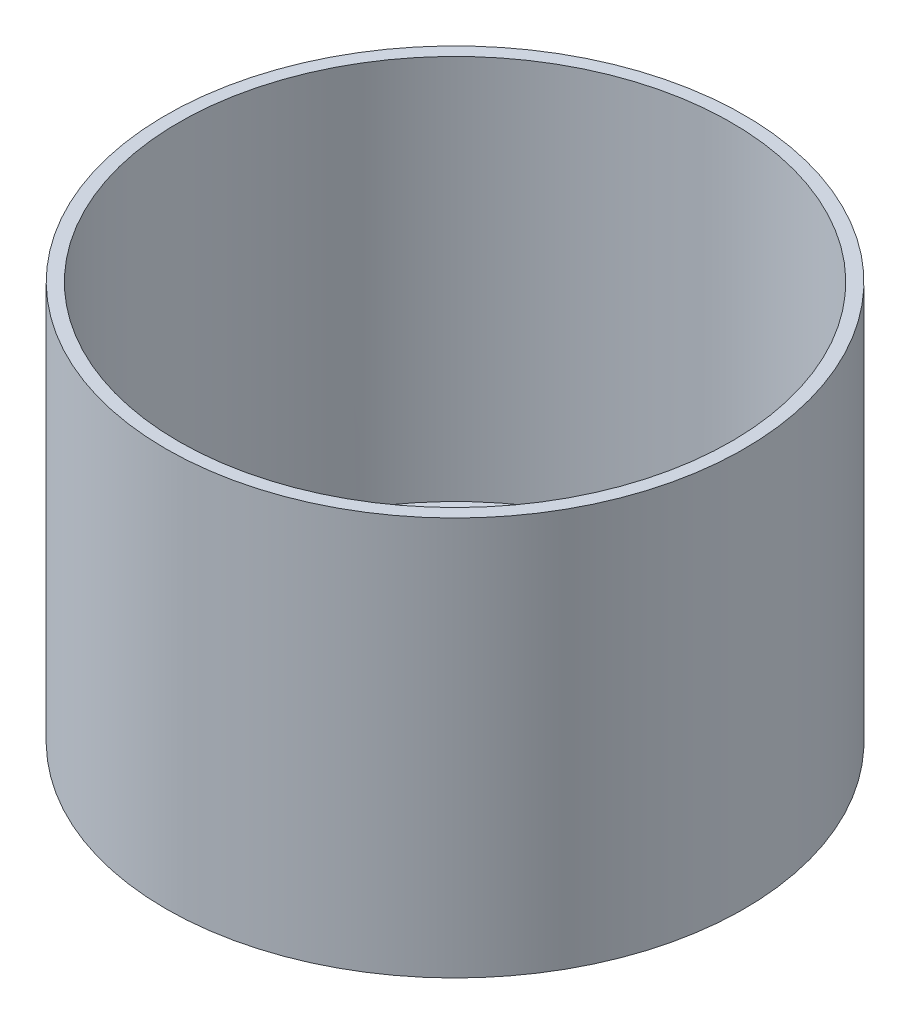
ISO-10303-21;
HEADER;
FILE_DESCRIPTION(('STEP AP214'),'2;1');
FILE_NAME('part.step','',(''),(''),'','','');
FILE_SCHEMA(('AUTOMOTIVE_DESIGN { 1 0 10303 214 1 1 1 1 }'));
ENDSEC;
DATA;
#1=APPLICATION_CONTEXT('core data for automotive mechanical design processes');
#2=APPLICATION_PROTOCOL_DEFINITION('international standard','automotive_design',2000,#1);
#3=PRODUCT_CONTEXT('',#1,'mechanical');
#4=PRODUCT('Part','Part','',(#3));
#5=PRODUCT_RELATED_PRODUCT_CATEGORY('part','',(#4));
#6=PRODUCT_DEFINITION_FORMATION('','',#4);
#7=PRODUCT_DEFINITION_CONTEXT('part definition',#1,'design');
#8=PRODUCT_DEFINITION('design','',#6,#7);
#9=PRODUCT_DEFINITION_SHAPE('','',#8);
#10=(LENGTH_UNIT() NAMED_UNIT(*) SI_UNIT(.MILLI.,.METRE.));
#11=(NAMED_UNIT(*) PLANE_ANGLE_UNIT() SI_UNIT($,.RADIAN.));
#12=(NAMED_UNIT(*) SI_UNIT($,.STERADIAN.) SOLID_ANGLE_UNIT());
#13=UNCERTAINTY_MEASURE_WITH_UNIT(LENGTH_MEASURE(1.E-05),#10,'distance_accuracy_value','');
#14=(GEOMETRIC_REPRESENTATION_CONTEXT(3) GLOBAL_UNCERTAINTY_ASSIGNED_CONTEXT((#13)) GLOBAL_UNIT_ASSIGNED_CONTEXT((#10,
#11,#12)) REPRESENTATION_CONTEXT('',''));
#15=CARTESIAN_POINT('',(0.,0.,0.));
#16=DIRECTION('',(0.,0.,1.));
#17=DIRECTION('',(1.,0.,0.));
#18=AXIS2_PLACEMENT_3D('',#15,#16,#17);
#19=CARTESIAN_POINT('',(16.5,62.,-24.5));
#20=DIRECTION('',(0.,-1.,0.));
#21=DIRECTION('',(0.,0.,-1.));
#22=AXIS2_PLACEMENT_3D('',#19,#20,#21);
#23=CYLINDRICAL_SURFACE('',#22,43.);
#24=CARTESIAN_POINT('',(16.5,62.,-24.5));
#25=DIRECTION('',(0.,1.,0.));
#26=DIRECTION('',(0.,0.,1.));
#27=AXIS2_PLACEMENT_3D('',#24,#25,#26);
#28=CIRCLE('',#27,43.);
#29=CARTESIAN_POINT('',(16.5,62.,18.5));
#30=VERTEX_POINT('',#29);
#31=EDGE_CURVE('E179',#30,#30,#28,.T.);
#32=ORIENTED_EDGE('',*,*,#31,.T.);
#33=EDGE_LOOP('',(#32));
#34=FACE_BOUND('',#33,.T.);
#35=CARTESIAN_POINT('',(16.5,2.,-24.5));
#36=DIRECTION('',(0.,1.,0.));
#37=DIRECTION('',(0.,0.,1.));
#38=AXIS2_PLACEMENT_3D('',#35,#36,#37);
#39=CIRCLE('',#38,43.);
#40=CARTESIAN_POINT('',(-12.7400336134731,2.,7.02808960725278));
#41=VERTEX_POINT('',#40);
#42=CARTESIAN_POINT('',(20.0246569480514,2.,18.3553006452942));
#43=VERTEX_POINT('',#42);
#44=EDGE_CURVE('E188',#41,#43,#39,.F.);
#45=ORIENTED_EDGE('',*,*,#44,.T.);
#46=DIRECTION('',(0.,-1.,0.));
#47=VECTOR('',#46,1.);
#48=CARTESIAN_POINT('',(20.0246569480514,12.,18.3553006452942));
#49=LINE('',#48,#47);
#50=CARTESIAN_POINT('',(20.0246569480514,22.,18.3553006452942));
#51=VERTEX_POINT('',#50);
#52=EDGE_CURVE('E176',#43,#51,#49,.F.);
#53=ORIENTED_EDGE('',*,*,#52,.T.);
#54=CARTESIAN_POINT('',(16.5,22.,-24.5));
#55=DIRECTION('',(0.,1.,0.));
#56=DIRECTION('',(0.,0.,1.));
#57=AXIS2_PLACEMENT_3D('',#54,#55,#56);
#58=CIRCLE('',#57,43.);
#59=CARTESIAN_POINT('',(5.42661257654479,22.,17.0497303357081));
#60=VERTEX_POINT('',#59);
#61=EDGE_CURVE('E11',#60,#51,#58,.T.);
#62=ORIENTED_EDGE('',*,*,#61,.F.);
#63=DIRECTION('',(0.,-1.,0.));
#64=VECTOR('',#63,1.);
#65=CARTESIAN_POINT('',(5.42661257654479,62.,17.0497303357081));
#66=LINE('',#65,#64);
#67=CARTESIAN_POINT('',(5.42661257654468,2.,17.0497303357081));
#68=VERTEX_POINT('',#67);
#69=EDGE_CURVE('E170',#60,#68,#66,.T.);
#70=ORIENTED_EDGE('',*,*,#69,.T.);
#71=CARTESIAN_POINT('',(0.140921145263424,2.,15.2665756512239));
#72=VERTEX_POINT('',#71);
#73=EDGE_CURVE('E189',#68,#72,#39,.F.);
#74=ORIENTED_EDGE('',*,*,#73,.T.);
#75=DIRECTION('',(0.,-1.,0.));
#76=VECTOR('',#75,1.);
#77=CARTESIAN_POINT('',(0.140921145263317,62.,15.2665756512238));
#78=LINE('',#77,#76);
#79=CARTESIAN_POINT('',(0.140921145263317,22.,15.2665756512238));
#80=VERTEX_POINT('',#79);
#81=EDGE_CURVE('E167',#72,#80,#78,.F.);
#82=ORIENTED_EDGE('',*,*,#81,.T.);
#83=CARTESIAN_POINT('',(-12.7400336134731,22.,7.02808960725279));
#84=VERTEX_POINT('',#83);
#85=EDGE_CURVE('E39',#84,#80,#58,.T.);
#86=ORIENTED_EDGE('',*,*,#85,.F.);
#87=DIRECTION('',(0.,-1.,0.));
#88=VECTOR('',#87,1.);
#89=CARTESIAN_POINT('',(-12.7400336134731,12.,7.02808960725278));
#90=LINE('',#89,#88);
#91=EDGE_CURVE('E173',#84,#41,#90,.T.);
#92=ORIENTED_EDGE('',*,*,#91,.T.);
#93=EDGE_LOOP('',(#45,#53,#62,#70,#74,#82,#86,#92));
#94=FACE_BOUND('',#93,.T.);
#95=ADVANCED_FACE('F35',(#34,#94),#23,.F.);
#96=CARTESIAN_POINT('',(16.5,2.,-24.5));
#97=DIRECTION('',(0.,1.,0.));
#98=DIRECTION('',(0.,0.,1.));
#99=AXIS2_PLACEMENT_3D('',#96,#97,#98);
#100=PLANE('',#99);
#101=DIRECTION('',(-0.947533885518577,0.,-0.319655339067048));
#102=VECTOR('',#101,1.);
#103=CARTESIAN_POINT('',(16.6228372296848,2.,5.73281430197921));
#104=LINE('',#103,#102);
#105=CARTESIAN_POINT('',(16.6228372296848,2.,5.73281430197921));
#106=VERTEX_POINT('',#105);
#107=CARTESIAN_POINT('',(13.7482956663537,2.,4.76307319600701));
#108=VERTEX_POINT('',#107);
#109=EDGE_CURVE('E125',#106,#108,#104,.T.);
#110=ORIENTED_EDGE('',*,*,#109,.F.);
#111=CARTESIAN_POINT('',(15.4191092150285,2.,12.8268711067982));
#112=DIRECTION('',(0.,1.,0.));
#113=DIRECTION('',(0.,0.,1.));
#114=AXIS2_PLACEMENT_3D('',#111,#112,#113);
#115=CIRCLE('',#114,7.19545711426782);
#116=EDGE_CURVE('E194',#106,#43,#115,.F.);
#117=ORIENTED_EDGE('',*,*,#116,.T.);
#118=ORIENTED_EDGE('',*,*,#44,.F.);
#119=CARTESIAN_POINT('',(0.,2.,0.));
#120=DIRECTION('',(0.,1.,0.));
#121=DIRECTION('',(0.,0.,1.));
#122=AXIS2_PLACEMENT_3D('',#119,#120,#121);
#123=CIRCLE('',#122,14.55);
#124=EDGE_CURVE('E151',#108,#41,#123,.T.);
#125=ORIENTED_EDGE('',*,*,#124,.F.);
#126=EDGE_LOOP('',(#110,#117,#118,#125));
#127=FACE_BOUND('',#126,.T.);
#128=ADVANCED_FACE('F211',(#127),#100,.T.);
#129=ORIENTED_EDGE('',*,*,#73,.F.);
#130=DIRECTION('',(-0.947533885518577,0.,-0.319655339067047));
#131=VECTOR('',#130,1.);
#132=CARTESIAN_POINT('',(2.78376686090405,2.,16.158152993466));
#133=LINE('',#132,#131);
#134=EDGE_CURVE('E192',#68,#72,#133,.T.);
#135=ORIENTED_EDGE('',*,*,#134,.T.);
#136=EDGE_LOOP('',(#129,#135));
#137=FACE_BOUND('',#136,.T.);
#138=ADVANCED_FACE('F209',(#137),#100,.T.);
#139=CARTESIAN_POINT('',(16.5,2.,-24.5));
#140=DIRECTION('',(0.,-1.,0.));
#141=DIRECTION('',(0.,0.,-1.));
#142=AXIS2_PLACEMENT_3D('',#139,#140,#141);
#143=CYLINDRICAL_SURFACE('',#142,45.);
#144=CARTESIAN_POINT('',(16.5,0.,-24.5));
#145=DIRECTION('',(0.,1.,0.));
#146=DIRECTION('',(0.,0.,1.));
#147=AXIS2_PLACEMENT_3D('',#144,#145,#146);
#148=CIRCLE('',#147,45.);
#149=CARTESIAN_POINT('',(16.5,0.,20.5));
#150=VERTEX_POINT('',#149);
#151=EDGE_CURVE('E185',#150,#150,#148,.T.);
#152=ORIENTED_EDGE('',*,*,#151,.T.);
#153=EDGE_LOOP('',(#152));
#154=FACE_BOUND('',#153,.T.);
#155=CARTESIAN_POINT('',(16.5,62.,-24.5));
#156=DIRECTION('',(0.,1.,0.));
#157=DIRECTION('',(0.,0.,1.));
#158=AXIS2_PLACEMENT_3D('',#155,#156,#157);
#159=CIRCLE('',#158,45.);
#160=CARTESIAN_POINT('',(16.5,62.,20.5));
#161=VERTEX_POINT('',#160);
#162=EDGE_CURVE('E182',#161,#161,#159,.T.);
#163=ORIENTED_EDGE('',*,*,#162,.F.);
#164=EDGE_LOOP('',(#163));
#165=FACE_BOUND('',#164,.T.);
#166=ADVANCED_FACE('F37',(#154,#165),#143,.T.);
#167=CARTESIAN_POINT('',(16.5,0.,-24.5));
#168=DIRECTION('',(0.,1.,0.));
#169=DIRECTION('',(0.,0.,1.));
#170=AXIS2_PLACEMENT_3D('',#167,#168,#169);
#171=PLANE('',#170);
#172=ORIENTED_EDGE('',*,*,#151,.F.);
#173=EDGE_LOOP('',(#172));
#174=FACE_BOUND('',#173,.T.);
#175=ADVANCED_FACE('F218',(#174),#171,.F.);
#176=CARTESIAN_POINT('',(16.5,62.,-24.5));
#177=DIRECTION('',(0.,1.,0.));
#178=DIRECTION('',(0.,0.,1.));
#179=AXIS2_PLACEMENT_3D('',#176,#177,#178);
#180=PLANE('',#179);
#181=ORIENTED_EDGE('',*,*,#162,.T.);
#182=EDGE_LOOP('',(#181));
#183=FACE_BOUND('',#182,.T.);
#184=ORIENTED_EDGE('',*,*,#31,.F.);
#185=EDGE_LOOP('',(#184));
#186=FACE_BOUND('',#185,.T.);
#187=ADVANCED_FACE('F231',(#183,#186),#180,.T.);
#188=CARTESIAN_POINT('',(15.4191092150285,22.,12.8268711067982));
#189=DIRECTION('',(0.,1.,0.));
#190=DIRECTION('',(0.,0.,1.));
#191=AXIS2_PLACEMENT_3D('',#188,#189,#190);
#192=PLANE('',#191);
#193=DIRECTION('',(-0.947533885518577,0.,-0.319655339067047));
#194=VECTOR('',#193,1.);
#195=CARTESIAN_POINT('',(16.4691425453701,22.,7.52994463900846));
#196=LINE('',#195,#194);
#197=CARTESIAN_POINT('',(16.4691425453701,22.,7.52994463900846));
#198=VERTEX_POINT('',#197);
#199=CARTESIAN_POINT('',(11.3524595635698,22.,5.8038058080464));
#200=VERTEX_POINT('',#199);
#201=EDGE_CURVE('E119',#198,#200,#196,.T.);
#202=ORIENTED_EDGE('',*,*,#201,.F.);
#203=CARTESIAN_POINT('',(15.4191092150285,22.,12.8268711067982));
#204=DIRECTION('',(0.,1.,0.));
#205=DIRECTION('',(0.,0.,1.));
#206=AXIS2_PLACEMENT_3D('',#203,#204,#205);
#207=CIRCLE('',#206,5.4);
#208=CARTESIAN_POINT('',(13.6929703840665,22.,17.9435540885985));
#209=VERTEX_POINT('',#208);
#210=EDGE_CURVE('E110',#209,#198,#207,.T.);
#211=ORIENTED_EDGE('',*,*,#210,.F.);
#212=DIRECTION('',(0.947533885518577,0.,0.319655339067047));
#213=VECTOR('',#212,1.);
#214=CARTESIAN_POINT('',(13.6929703840665,22.,17.9435540885985));
#215=LINE('',#214,#213);
#216=CARTESIAN_POINT('',(-2.34877829776304,22.,12.5317891981934));
#217=VERTEX_POINT('',#216);
#218=EDGE_CURVE('E134',#217,#209,#215,.T.);
#219=ORIENTED_EDGE('',*,*,#218,.F.);
#220=CARTESIAN_POINT('',(0.,22.,0.));
#221=DIRECTION('',(0.,1.,0.));
#222=DIRECTION('',(0.,0.,1.));
#223=AXIS2_PLACEMENT_3D('',#220,#221,#222);
#224=CIRCLE('',#223,12.75);
#225=EDGE_CURVE('E132',#200,#217,#224,.T.);
#226=ORIENTED_EDGE('',*,*,#225,.F.);
#227=EDGE_LOOP('',(#202,#211,#219,#226));
#228=FACE_BOUND('',#227,.T.);
#229=CARTESIAN_POINT('',(0.,22.,0.));
#230=DIRECTION('',(0.,1.,0.));
#231=DIRECTION('',(0.,0.,1.));
#232=AXIS2_PLACEMENT_3D('',#229,#230,#231);
#233=CIRCLE('',#232,14.55);
#234=CARTESIAN_POINT('',(13.7482956663537,22.,4.76307319600701));
#235=VERTEX_POINT('',#234);
#236=EDGE_CURVE('E153',#235,#84,#233,.T.);
#237=ORIENTED_EDGE('',*,*,#236,.T.);
#238=ORIENTED_EDGE('',*,*,#85,.T.);
#239=DIRECTION('',(0.947533885518577,0.,0.319655339067047));
#240=VECTOR('',#239,1.);
#241=CARTESIAN_POINT('',(13.1190429314248,22.,19.6448105443627));
#242=LINE('',#241,#240);
#243=EDGE_CURVE('E156',#80,#60,#242,.T.);
#244=ORIENTED_EDGE('',*,*,#243,.T.);
#245=ORIENTED_EDGE('',*,*,#61,.T.);
#246=CARTESIAN_POINT('',(15.4191092150285,22.,12.8268711067982));
#247=DIRECTION('',(0.,1.,0.));
#248=DIRECTION('',(0.,0.,1.));
#249=AXIS2_PLACEMENT_3D('',#246,#247,#248);
#250=CIRCLE('',#249,7.19545711426782);
#251=CARTESIAN_POINT('',(16.6228372296848,22.,5.73281430197921));
#252=VERTEX_POINT('',#251);
#253=EDGE_CURVE('E148',#51,#252,#250,.T.);
#254=ORIENTED_EDGE('',*,*,#253,.T.);
#255=DIRECTION('',(-0.947533885518577,0.,-0.319655339067048));
#256=VECTOR('',#255,1.);
#257=CARTESIAN_POINT('',(16.6228372296848,22.,5.73281430197921));
#258=LINE('',#257,#256);
#259=EDGE_CURVE('E150',#252,#235,#258,.T.);
#260=ORIENTED_EDGE('',*,*,#259,.T.);
#261=EDGE_LOOP('',(#237,#238,#244,#245,#254,#260));
#262=FACE_BOUND('',#261,.T.);
#263=ADVANCED_FACE('F129',(#228,#262),#192,.T.);
#264=CARTESIAN_POINT('',(15.4191092150285,22.,12.8268711067982));
#265=DIRECTION('',(0.,-1.,0.));
#266=DIRECTION('',(0.,0.,-1.));
#267=AXIS2_PLACEMENT_3D('',#264,#265,#266);
#268=CYLINDRICAL_SURFACE('',#267,7.19545711426782);
#269=ORIENTED_EDGE('',*,*,#52,.F.);
#270=ORIENTED_EDGE('',*,*,#116,.F.);
#271=DIRECTION('',(0.,-1.,0.));
#272=VECTOR('',#271,1.);
#273=CARTESIAN_POINT('',(16.6228372296848,22.,5.73281430197921));
#274=LINE('',#273,#272);
#275=EDGE_CURVE('E164',#252,#106,#274,.T.);
#276=ORIENTED_EDGE('',*,*,#275,.F.);
#277=ORIENTED_EDGE('',*,*,#253,.F.);
#278=EDGE_LOOP('',(#269,#270,#276,#277));
#279=FACE_BOUND('',#278,.T.);
#280=ADVANCED_FACE('F229',(#279),#268,.T.);
#281=CARTESIAN_POINT('',(16.6228372296848,22.,5.73281430197921));
#282=DIRECTION('',(-0.319655339067048,0.,0.947533885518577));
#283=DIRECTION('',(0.947533885518577,0.,0.319655339067048));
#284=AXIS2_PLACEMENT_3D('',#281,#282,#283);
#285=PLANE('',#284);
#286=ORIENTED_EDGE('',*,*,#109,.T.);
#287=DIRECTION('',(0.,-1.,0.));
#288=VECTOR('',#287,1.);
#289=CARTESIAN_POINT('',(13.7482956663537,22.,4.76307319600701));
#290=LINE('',#289,#288);
#291=EDGE_CURVE('E159',#235,#108,#290,.T.);
#292=ORIENTED_EDGE('',*,*,#291,.F.);
#293=ORIENTED_EDGE('',*,*,#259,.F.);
#294=ORIENTED_EDGE('',*,*,#275,.T.);
#295=EDGE_LOOP('',(#286,#292,#293,#294));
#296=FACE_BOUND('',#295,.T.);
#297=ADVANCED_FACE('F286',(#296),#285,.F.);
#298=CARTESIAN_POINT('',(0.,22.,0.));
#299=DIRECTION('',(0.,-1.,0.));
#300=DIRECTION('',(0.,0.,-1.));
#301=AXIS2_PLACEMENT_3D('',#298,#299,#300);
#302=CYLINDRICAL_SURFACE('',#301,14.55);
#303=ORIENTED_EDGE('',*,*,#91,.F.);
#304=ORIENTED_EDGE('',*,*,#236,.F.);
#305=ORIENTED_EDGE('',*,*,#291,.T.);
#306=ORIENTED_EDGE('',*,*,#124,.T.);
#307=EDGE_LOOP('',(#303,#304,#305,#306));
#308=FACE_BOUND('',#307,.T.);
#309=ADVANCED_FACE('F295',(#308),#302,.T.);
#310=CARTESIAN_POINT('',(13.1190429314248,22.,19.6448105443627));
#311=DIRECTION('',(0.319655339067047,0.,-0.947533885518577));
#312=DIRECTION('',(-0.947533885518577,0.,-0.319655339067047));
#313=AXIS2_PLACEMENT_3D('',#310,#311,#312);
#314=PLANE('',#313);
#315=ORIENTED_EDGE('',*,*,#69,.F.);
#316=ORIENTED_EDGE('',*,*,#243,.F.);
#317=ORIENTED_EDGE('',*,*,#81,.F.);
#318=ORIENTED_EDGE('',*,*,#134,.F.);
#319=EDGE_LOOP('',(#315,#316,#317,#318));
#320=FACE_BOUND('',#319,.T.);
#321=ADVANCED_FACE('F206',(#320),#314,.F.);
#322=CARTESIAN_POINT('',(15.4191092150285,22.,12.8268711067982));
#323=DIRECTION('',(0.,-1.,0.));
#324=DIRECTION('',(0.,0.,-1.));
#325=AXIS2_PLACEMENT_3D('',#322,#323,#324);
#326=CYLINDRICAL_SURFACE('',#325,5.4);
#327=CARTESIAN_POINT('',(15.4191092150285,2.,12.8268711067982));
#328=DIRECTION('',(0.,1.,0.));
#329=DIRECTION('',(0.,0.,1.));
#330=AXIS2_PLACEMENT_3D('',#327,#328,#329);
#331=CIRCLE('',#330,5.4);
#332=CARTESIAN_POINT('',(13.6929703840665,2.,17.9435540885985));
#333=VERTEX_POINT('',#332);
#334=CARTESIAN_POINT('',(16.4691425453701,2.,7.52994463900845));
#335=VERTEX_POINT('',#334);
#336=EDGE_CURVE('E50',#333,#335,#331,.T.);
#337=ORIENTED_EDGE('',*,*,#336,.F.);
#338=DIRECTION('',(0.,-1.,0.));
#339=VECTOR('',#338,1.);
#340=CARTESIAN_POINT('',(13.6929703840665,22.,17.9435540885985));
#341=LINE('',#340,#339);
#342=EDGE_CURVE('E115',#209,#333,#341,.T.);
#343=ORIENTED_EDGE('',*,*,#342,.F.);
#344=ORIENTED_EDGE('',*,*,#210,.T.);
#345=DIRECTION('',(0.,-1.,0.));
#346=VECTOR('',#345,1.);
#347=CARTESIAN_POINT('',(16.4691425453701,22.,7.52994463900846));
#348=LINE('',#347,#346);
#349=EDGE_CURVE('E113',#198,#335,#348,.T.);
#350=ORIENTED_EDGE('',*,*,#349,.T.);
#351=EDGE_LOOP('',(#337,#343,#344,#350));
#352=FACE_BOUND('',#351,.T.);
#353=ADVANCED_FACE('F112',(#352),#326,.F.);
#354=CARTESIAN_POINT('',(16.4691425453701,22.,7.52994463900846));
#355=DIRECTION('',(-0.319655339067047,0.,0.947533885518577));
#356=DIRECTION('',(0.947533885518577,0.,0.319655339067047));
#357=AXIS2_PLACEMENT_3D('',#354,#355,#356);
#358=PLANE('',#357);
#359=DIRECTION('',(-0.947533885518577,0.,-0.319655339067047));
#360=VECTOR('',#359,1.);
#361=CARTESIAN_POINT('',(16.4691425453701,2.,7.52994463900846));
#362=LINE('',#361,#360);
#363=CARTESIAN_POINT('',(11.3524595635698,2.,5.8038058080464));
#364=VERTEX_POINT('',#363);
#365=EDGE_CURVE('E54',#335,#364,#362,.T.);
#366=ORIENTED_EDGE('',*,*,#365,.F.);
#367=ORIENTED_EDGE('',*,*,#349,.F.);
#368=ORIENTED_EDGE('',*,*,#201,.T.);
#369=DIRECTION('',(0.,-1.,0.));
#370=VECTOR('',#369,1.);
#371=CARTESIAN_POINT('',(11.3524595635698,22.,5.8038058080464));
#372=LINE('',#371,#370);
#373=EDGE_CURVE('E126',#200,#364,#372,.T.);
#374=ORIENTED_EDGE('',*,*,#373,.T.);
#375=EDGE_LOOP('',(#366,#367,#368,#374));
#376=FACE_BOUND('',#375,.T.);
#377=ADVANCED_FACE('F123',(#376),#358,.T.);
#378=CARTESIAN_POINT('',(0.,22.,0.));
#379=DIRECTION('',(0.,-1.,0.));
#380=DIRECTION('',(0.,0.,-1.));
#381=AXIS2_PLACEMENT_3D('',#378,#379,#380);
#382=CYLINDRICAL_SURFACE('',#381,12.75);
#383=CARTESIAN_POINT('',(0.,2.,0.));
#384=DIRECTION('',(0.,1.,0.));
#385=DIRECTION('',(0.,0.,1.));
#386=AXIS2_PLACEMENT_3D('',#383,#384,#385);
#387=CIRCLE('',#386,12.75);
#388=CARTESIAN_POINT('',(-2.34877829776304,2.,12.5317891981934));
#389=VERTEX_POINT('',#388);
#390=EDGE_CURVE('E140',#364,#389,#387,.T.);
#391=ORIENTED_EDGE('',*,*,#390,.F.);
#392=ORIENTED_EDGE('',*,*,#373,.F.);
#393=ORIENTED_EDGE('',*,*,#225,.T.);
#394=DIRECTION('',(0.,-1.,0.));
#395=VECTOR('',#394,1.);
#396=CARTESIAN_POINT('',(-2.34877829776304,22.,12.5317891981934));
#397=LINE('',#396,#395);
#398=EDGE_CURVE('E144',#217,#389,#397,.T.);
#399=ORIENTED_EDGE('',*,*,#398,.T.);
#400=EDGE_LOOP('',(#391,#392,#393,#399));
#401=FACE_BOUND('',#400,.T.);
#402=ADVANCED_FACE('F329',(#401),#382,.F.);
#403=CARTESIAN_POINT('',(13.6929703840665,22.,17.9435540885985));
#404=DIRECTION('',(0.319655339067047,0.,-0.947533885518577));
#405=DIRECTION('',(-0.947533885518577,0.,-0.319655339067047));
#406=AXIS2_PLACEMENT_3D('',#403,#404,#405);
#407=PLANE('',#406);
#408=DIRECTION('',(0.947533885518577,0.,0.319655339067047));
#409=VECTOR('',#408,1.);
#410=CARTESIAN_POINT('',(13.6929703840665,2.,17.9435540885985));
#411=LINE('',#410,#409);
#412=EDGE_CURVE('E120',#389,#333,#411,.T.);
#413=ORIENTED_EDGE('',*,*,#412,.F.);
#414=ORIENTED_EDGE('',*,*,#398,.F.);
#415=ORIENTED_EDGE('',*,*,#218,.T.);
#416=ORIENTED_EDGE('',*,*,#342,.T.);
#417=EDGE_LOOP('',(#413,#414,#415,#416));
#418=FACE_BOUND('',#417,.T.);
#419=ADVANCED_FACE('F222',(#418),#407,.T.);
#420=ORIENTED_EDGE('',*,*,#336,.T.);
#421=ORIENTED_EDGE('',*,*,#365,.T.);
#422=ORIENTED_EDGE('',*,*,#390,.T.);
#423=ORIENTED_EDGE('',*,*,#412,.T.);
#424=EDGE_LOOP('',(#420,#421,#422,#423));
#425=FACE_BOUND('',#424,.T.);
#426=ADVANCED_FACE('F213',(#425),#100,.T.);
#427=CLOSED_SHELL('',(#95,#128,#138,#166,#175,#187,#263,#280,#297,#309,#321,#353,#377,#402,#419,#426));
#428=MANIFOLD_SOLID_BREP('B2',#427);
#429=ADVANCED_BREP_SHAPE_REPRESENTATION('',(#18,#428),#14);
#430=SHAPE_DEFINITION_REPRESENTATION(#9,#429);
ENDSEC;
END-ISO-10303-21;
